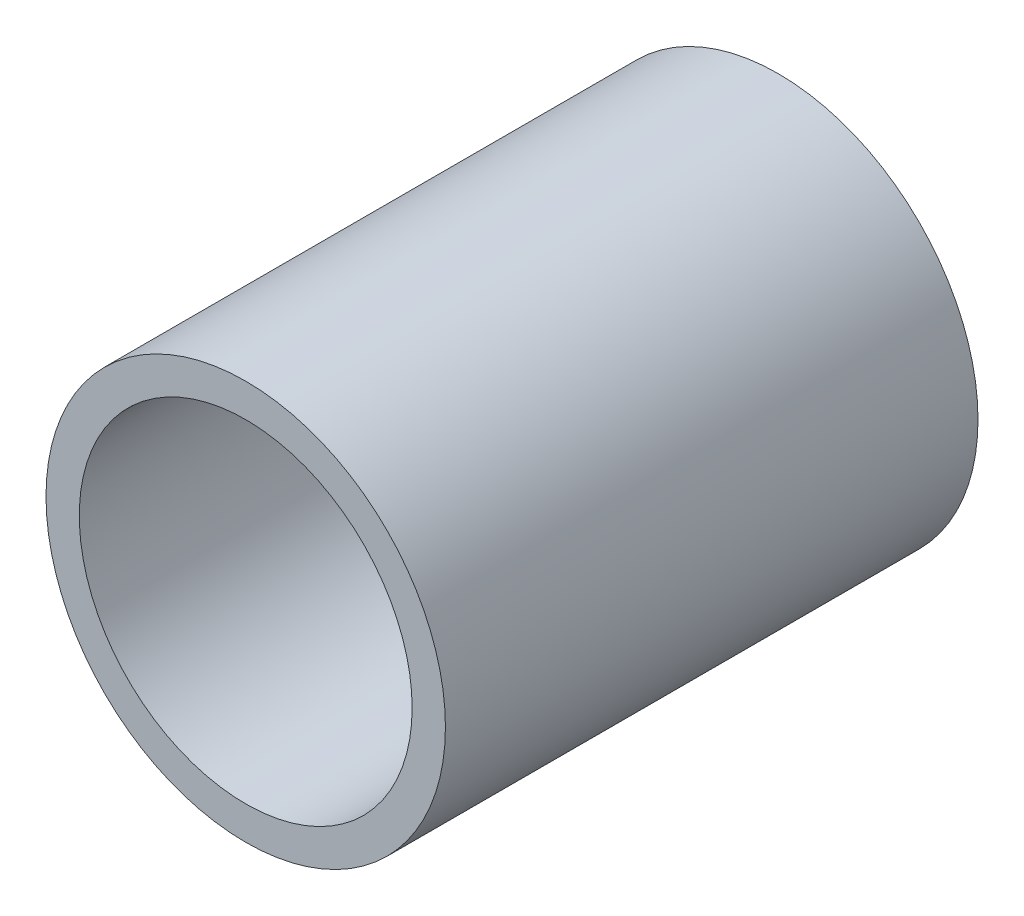
ISO-10303-21;
HEADER;
FILE_DESCRIPTION(('STEP AP214'),'2;1');
FILE_NAME('part.step','',(''),(''),'','','');
FILE_SCHEMA(('AUTOMOTIVE_DESIGN { 1 0 10303 214 1 1 1 1 }'));
ENDSEC;
DATA;
#1=APPLICATION_CONTEXT('core data for automotive mechanical design processes');
#2=APPLICATION_PROTOCOL_DEFINITION('international standard','automotive_design',2000,#1);
#3=PRODUCT_CONTEXT('',#1,'mechanical');
#4=PRODUCT('Part','Part','',(#3));
#5=PRODUCT_RELATED_PRODUCT_CATEGORY('part','',(#4));
#6=PRODUCT_DEFINITION_FORMATION('','',#4);
#7=PRODUCT_DEFINITION_CONTEXT('part definition',#1,'design');
#8=PRODUCT_DEFINITION('design','',#6,#7);
#9=PRODUCT_DEFINITION_SHAPE('','',#8);
#10=(LENGTH_UNIT() NAMED_UNIT(*) SI_UNIT(.MILLI.,.METRE.));
#11=(NAMED_UNIT(*) PLANE_ANGLE_UNIT() SI_UNIT($,.RADIAN.));
#12=(NAMED_UNIT(*) SI_UNIT($,.STERADIAN.) SOLID_ANGLE_UNIT());
#13=UNCERTAINTY_MEASURE_WITH_UNIT(LENGTH_MEASURE(1.E-05),#10,'distance_accuracy_value','');
#14=(GEOMETRIC_REPRESENTATION_CONTEXT(3) GLOBAL_UNCERTAINTY_ASSIGNED_CONTEXT((#13)) GLOBAL_UNIT_ASSIGNED_CONTEXT((#10,
#11,#12)) REPRESENTATION_CONTEXT('',''));
#15=CARTESIAN_POINT('',(0.,0.,0.));
#16=DIRECTION('',(0.,0.,1.));
#17=DIRECTION('',(1.,0.,0.));
#18=AXIS2_PLACEMENT_3D('',#15,#16,#17);
#19=CARTESIAN_POINT('',(0.,0.,8.));
#20=DIRECTION('',(0.,0.,-1.));
#21=DIRECTION('',(-1.,0.,0.));
#22=AXIS2_PLACEMENT_3D('',#19,#20,#21);
#23=CYLINDRICAL_SURFACE('',#22,3.);
#24=CARTESIAN_POINT('',(0.,0.,8.));
#25=DIRECTION('',(0.,0.,1.));
#26=DIRECTION('',(1.,0.,0.));
#27=AXIS2_PLACEMENT_3D('',#24,#25,#26);
#28=CIRCLE('',#27,3.);
#29=CARTESIAN_POINT('',(3.,0.,8.));
#30=VERTEX_POINT('',#29);
#31=EDGE_CURVE('E10',#30,#30,#28,.T.);
#32=ORIENTED_EDGE('',*,*,#31,.F.);
#33=EDGE_LOOP('',(#32));
#34=FACE_BOUND('',#33,.T.);
#35=CARTESIAN_POINT('',(0.,0.,0.));
#36=DIRECTION('',(0.,0.,1.));
#37=DIRECTION('',(1.,0.,0.));
#38=AXIS2_PLACEMENT_3D('',#35,#36,#37);
#39=CIRCLE('',#38,3.);
#40=CARTESIAN_POINT('',(3.,0.,0.));
#41=VERTEX_POINT('',#40);
#42=EDGE_CURVE('E35',#41,#41,#39,.T.);
#43=ORIENTED_EDGE('',*,*,#42,.T.);
#44=EDGE_LOOP('',(#43));
#45=FACE_BOUND('',#44,.T.);
#46=ADVANCED_FACE('F32',(#34,#45),#23,.T.);
#47=CARTESIAN_POINT('',(0.,0.,8.));
#48=DIRECTION('',(0.,0.,1.));
#49=DIRECTION('',(1.,0.,0.));
#50=AXIS2_PLACEMENT_3D('',#47,#48,#49);
#51=PLANE('',#50);
#52=CARTESIAN_POINT('',(0.,0.,8.));
#53=DIRECTION('',(0.,0.,1.));
#54=DIRECTION('',(1.,0.,0.));
#55=AXIS2_PLACEMENT_3D('',#52,#53,#54);
#56=CIRCLE('',#55,2.5);
#57=CARTESIAN_POINT('',(2.5,0.,8.));
#58=VERTEX_POINT('',#57);
#59=EDGE_CURVE('E44',#58,#58,#56,.T.);
#60=ORIENTED_EDGE('',*,*,#59,.F.);
#61=EDGE_LOOP('',(#60));
#62=FACE_BOUND('',#61,.T.);
#63=ORIENTED_EDGE('',*,*,#31,.T.);
#64=EDGE_LOOP('',(#63));
#65=FACE_BOUND('',#64,.T.);
#66=ADVANCED_FACE('F59',(#62,#65),#51,.T.);
#67=CARTESIAN_POINT('',(0.,0.,0.));
#68=DIRECTION('',(0.,0.,1.));
#69=DIRECTION('',(1.,0.,0.));
#70=AXIS2_PLACEMENT_3D('',#67,#68,#69);
#71=PLANE('',#70);
#72=ORIENTED_EDGE('',*,*,#42,.F.);
#73=EDGE_LOOP('',(#72));
#74=FACE_BOUND('',#73,.T.);
#75=ADVANCED_FACE('F55',(#74),#71,.F.);
#76=CARTESIAN_POINT('',(0.,0.,1.));
#77=DIRECTION('',(0.,0.,1.));
#78=DIRECTION('',(1.,0.,0.));
#79=AXIS2_PLACEMENT_3D('',#76,#77,#78);
#80=CYLINDRICAL_SURFACE('',#79,2.5);
#81=CARTESIAN_POINT('',(0.,0.,1.));
#82=DIRECTION('',(0.,0.,1.));
#83=DIRECTION('',(1.,0.,0.));
#84=AXIS2_PLACEMENT_3D('',#81,#82,#83);
#85=CIRCLE('',#84,2.5);
#86=CARTESIAN_POINT('',(2.5,0.,1.));
#87=VERTEX_POINT('',#86);
#88=EDGE_CURVE('E42',#87,#87,#85,.T.);
#89=ORIENTED_EDGE('',*,*,#88,.F.);
#90=EDGE_LOOP('',(#89));
#91=FACE_BOUND('',#90,.T.);
#92=ORIENTED_EDGE('',*,*,#59,.T.);
#93=EDGE_LOOP('',(#92));
#94=FACE_BOUND('',#93,.T.);
#95=ADVANCED_FACE('F52',(#91,#94),#80,.F.);
#96=CARTESIAN_POINT('',(0.,0.,1.));
#97=DIRECTION('',(0.,0.,1.));
#98=DIRECTION('',(1.,0.,0.));
#99=AXIS2_PLACEMENT_3D('',#96,#97,#98);
#100=PLANE('',#99);
#101=ORIENTED_EDGE('',*,*,#88,.T.);
#102=EDGE_LOOP('',(#101));
#103=FACE_BOUND('',#102,.T.);
#104=ADVANCED_FACE('F50',(#103),#100,.T.);
#105=CLOSED_SHELL('',(#46,#66,#75,#95,#104));
#106=MANIFOLD_SOLID_BREP('B2',#105);
#107=ADVANCED_BREP_SHAPE_REPRESENTATION('',(#18,#106),#14);
#108=SHAPE_DEFINITION_REPRESENTATION(#9,#107);
ENDSEC;
END-ISO-10303-21;
